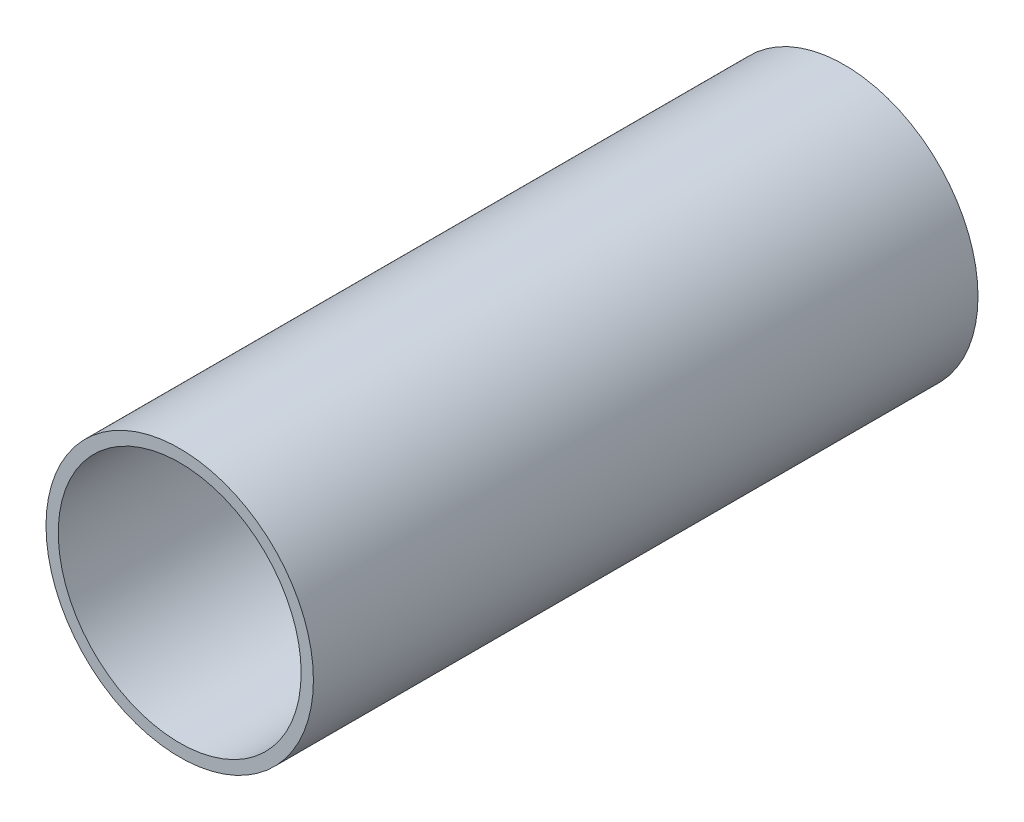
ISO-10303-21;
HEADER;
FILE_DESCRIPTION(('STEP AP214'),'2;1');
FILE_NAME('part.step','',(''),(''),'','','');
FILE_SCHEMA(('AUTOMOTIVE_DESIGN { 1 0 10303 214 1 1 1 1 }'));
ENDSEC;
DATA;
#1=APPLICATION_CONTEXT('core data for automotive mechanical design processes');
#2=APPLICATION_PROTOCOL_DEFINITION('international standard','automotive_design',2000,#1);
#3=PRODUCT_CONTEXT('',#1,'mechanical');
#4=PRODUCT('Part','Part','',(#3));
#5=PRODUCT_RELATED_PRODUCT_CATEGORY('part','',(#4));
#6=PRODUCT_DEFINITION_FORMATION('','',#4);
#7=PRODUCT_DEFINITION_CONTEXT('part definition',#1,'design');
#8=PRODUCT_DEFINITION('design','',#6,#7);
#9=PRODUCT_DEFINITION_SHAPE('','',#8);
#10=(LENGTH_UNIT() NAMED_UNIT(*) SI_UNIT(.MILLI.,.METRE.));
#11=(NAMED_UNIT(*) PLANE_ANGLE_UNIT() SI_UNIT($,.RADIAN.));
#12=(NAMED_UNIT(*) SI_UNIT($,.STERADIAN.) SOLID_ANGLE_UNIT());
#13=UNCERTAINTY_MEASURE_WITH_UNIT(LENGTH_MEASURE(1.E-05),#10,'distance_accuracy_value','');
#14=(GEOMETRIC_REPRESENTATION_CONTEXT(3) GLOBAL_UNCERTAINTY_ASSIGNED_CONTEXT((#13)) GLOBAL_UNIT_ASSIGNED_CONTEXT((#10,
#11,#12)) REPRESENTATION_CONTEXT('',''));
#15=CARTESIAN_POINT('',(0.,0.,0.));
#16=DIRECTION('',(0.,0.,1.));
#17=DIRECTION('',(1.,0.,0.));
#18=AXIS2_PLACEMENT_3D('',#15,#16,#17);
#19=CARTESIAN_POINT('',(0.,0.,420.));
#20=DIRECTION('',(0.,0.,1.));
#21=DIRECTION('',(1.,0.,0.));
#22=AXIS2_PLACEMENT_3D('',#19,#20,#21);
#23=PLANE('',#22);
#24=CARTESIAN_POINT('',(0.,0.,420.));
#25=DIRECTION('',(0.,0.,1.));
#26=DIRECTION('',(1.,0.,0.));
#27=AXIS2_PLACEMENT_3D('',#24,#25,#26);
#28=CIRCLE('',#27,84.5);
#29=CARTESIAN_POINT('',(84.5,0.,420.));
#30=VERTEX_POINT('',#29);
#31=EDGE_CURVE('E10',#30,#30,#28,.T.);
#32=ORIENTED_EDGE('',*,*,#31,.T.);
#33=EDGE_LOOP('',(#32));
#34=FACE_BOUND('',#33,.T.);
#35=CARTESIAN_POINT('',(0.,0.,420.));
#36=DIRECTION('',(0.,0.,1.));
#37=DIRECTION('',(1.,0.,0.));
#38=AXIS2_PLACEMENT_3D('',#35,#36,#37);
#39=CIRCLE('',#38,76.75);
#40=CARTESIAN_POINT('',(76.75,0.,420.));
#41=VERTEX_POINT('',#40);
#42=EDGE_CURVE('E54',#41,#41,#39,.T.);
#43=ORIENTED_EDGE('',*,*,#42,.F.);
#44=EDGE_LOOP('',(#43));
#45=FACE_BOUND('',#44,.T.);
#46=ADVANCED_FACE('F43',(#34,#45),#23,.T.);
#47=CARTESIAN_POINT('',(0.,0.,0.));
#48=DIRECTION('',(0.,0.,1.));
#49=DIRECTION('',(1.,0.,0.));
#50=AXIS2_PLACEMENT_3D('',#47,#48,#49);
#51=PLANE('',#50);
#52=CARTESIAN_POINT('',(0.,0.,0.));
#53=DIRECTION('',(0.,0.,1.));
#54=DIRECTION('',(1.,0.,0.));
#55=AXIS2_PLACEMENT_3D('',#52,#53,#54);
#56=CIRCLE('',#55,84.5);
#57=CARTESIAN_POINT('',(84.5,0.,0.));
#58=VERTEX_POINT('',#57);
#59=EDGE_CURVE('E47',#58,#58,#56,.T.);
#60=ORIENTED_EDGE('',*,*,#59,.F.);
#61=EDGE_LOOP('',(#60));
#62=FACE_BOUND('',#61,.T.);
#63=CARTESIAN_POINT('',(0.,0.,0.));
#64=DIRECTION('',(0.,0.,1.));
#65=DIRECTION('',(1.,0.,0.));
#66=AXIS2_PLACEMENT_3D('',#63,#64,#65);
#67=CIRCLE('',#66,76.75);
#68=CARTESIAN_POINT('',(76.75,0.,0.));
#69=VERTEX_POINT('',#68);
#70=EDGE_CURVE('E56',#69,#69,#67,.T.);
#71=ORIENTED_EDGE('',*,*,#70,.T.);
#72=EDGE_LOOP('',(#71));
#73=FACE_BOUND('',#72,.T.);
#74=ADVANCED_FACE('F66',(#62,#73),#51,.F.);
#75=CARTESIAN_POINT('',(0.,0.,420.));
#76=DIRECTION('',(0.,0.,-1.));
#77=DIRECTION('',(-1.,0.,0.));
#78=AXIS2_PLACEMENT_3D('',#75,#76,#77);
#79=CYLINDRICAL_SURFACE('',#78,84.5);
#80=ORIENTED_EDGE('',*,*,#31,.F.);
#81=EDGE_LOOP('',(#80));
#82=FACE_BOUND('',#81,.T.);
#83=ORIENTED_EDGE('',*,*,#59,.T.);
#84=EDGE_LOOP('',(#83));
#85=FACE_BOUND('',#84,.T.);
#86=ADVANCED_FACE('F45',(#82,#85),#79,.T.);
#87=CARTESIAN_POINT('',(0.,0.,420.));
#88=DIRECTION('',(0.,0.,-1.));
#89=DIRECTION('',(-1.,0.,0.));
#90=AXIS2_PLACEMENT_3D('',#87,#88,#89);
#91=CYLINDRICAL_SURFACE('',#90,76.75);
#92=ORIENTED_EDGE('',*,*,#42,.T.);
#93=EDGE_LOOP('',(#92));
#94=FACE_BOUND('',#93,.T.);
#95=ORIENTED_EDGE('',*,*,#70,.F.);
#96=EDGE_LOOP('',(#95));
#97=FACE_BOUND('',#96,.T.);
#98=ADVANCED_FACE('F62',(#94,#97),#91,.F.);
#99=CLOSED_SHELL('',(#46,#74,#86,#98));
#100=MANIFOLD_SOLID_BREP('B2',#99);
#101=ADVANCED_BREP_SHAPE_REPRESENTATION('',(#18,#100),#14);
#102=SHAPE_DEFINITION_REPRESENTATION(#9,#101);
ENDSEC;
END-ISO-10303-21;
